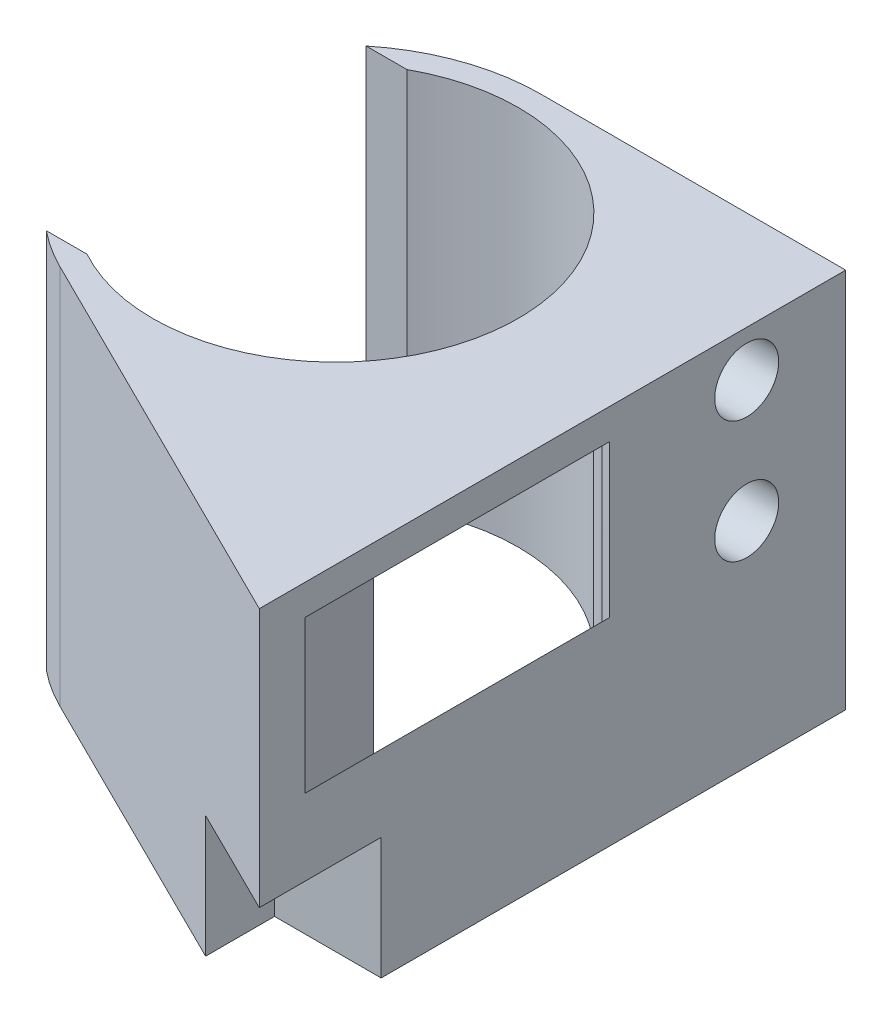
ISO-10303-21;
HEADER;
FILE_DESCRIPTION(('STEP AP214'),'2;1');
FILE_NAME('part.step','',(''),(''),'','','');
FILE_SCHEMA(('AUTOMOTIVE_DESIGN { 1 0 10303 214 1 1 1 1 }'));
ENDSEC;
DATA;
#1=APPLICATION_CONTEXT('core data for automotive mechanical design processes');
#2=APPLICATION_PROTOCOL_DEFINITION('international standard','automotive_design',2000,#1);
#3=PRODUCT_CONTEXT('',#1,'mechanical');
#4=PRODUCT('Part','Part','',(#3));
#5=PRODUCT_RELATED_PRODUCT_CATEGORY('part','',(#4));
#6=PRODUCT_DEFINITION_FORMATION('','',#4);
#7=PRODUCT_DEFINITION_CONTEXT('part definition',#1,'design');
#8=PRODUCT_DEFINITION('design','',#6,#7);
#9=PRODUCT_DEFINITION_SHAPE('','',#8);
#10=(LENGTH_UNIT() NAMED_UNIT(*) SI_UNIT(.MILLI.,.METRE.));
#11=(NAMED_UNIT(*) PLANE_ANGLE_UNIT() SI_UNIT($,.RADIAN.));
#12=(NAMED_UNIT(*) SI_UNIT($,.STERADIAN.) SOLID_ANGLE_UNIT());
#13=UNCERTAINTY_MEASURE_WITH_UNIT(LENGTH_MEASURE(1.E-05),#10,'distance_accuracy_value','');
#14=(GEOMETRIC_REPRESENTATION_CONTEXT(3) GLOBAL_UNCERTAINTY_ASSIGNED_CONTEXT((#13)) GLOBAL_UNIT_ASSIGNED_CONTEXT((#10,
#11,#12)) REPRESENTATION_CONTEXT('',''));
#15=CARTESIAN_POINT('',(0.,0.,0.));
#16=DIRECTION('',(0.,0.,1.));
#17=DIRECTION('',(1.,0.,0.));
#18=AXIS2_PLACEMENT_3D('',#15,#16,#17);
#19=CARTESIAN_POINT('',(0.,25.,0.));
#20=DIRECTION('',(0.,-1.,0.));
#21=DIRECTION('',(0.,0.,-1.));
#22=AXIS2_PLACEMENT_3D('',#19,#20,#21);
#23=CYLINDRICAL_SURFACE('',#22,13.5);
#24=CARTESIAN_POINT('',(0.,0.,0.));
#25=DIRECTION('',(0.,1.,0.));
#26=DIRECTION('',(0.,0.,1.));
#27=AXIS2_PLACEMENT_3D('',#24,#25,#26);
#28=CIRCLE('',#27,13.5);
#29=CARTESIAN_POINT('',(0.,0.,-13.5));
#30=VERTEX_POINT('',#29);
#31=CARTESIAN_POINT('',(-8.48528137423857,0.,-10.5));
#32=VERTEX_POINT('',#31);
#33=EDGE_CURVE('E207',#30,#32,#28,.T.);
#34=ORIENTED_EDGE('',*,*,#33,.T.);
#35=DIRECTION('',(0.,-1.,0.));
#36=VECTOR('',#35,1.);
#37=CARTESIAN_POINT('',(-8.48528137423857,25.,-10.5));
#38=LINE('',#37,#36);
#39=CARTESIAN_POINT('',(-8.48528137423857,25.,-10.5));
#40=VERTEX_POINT('',#39);
#41=EDGE_CURVE('E555',#32,#40,#38,.F.);
#42=ORIENTED_EDGE('',*,*,#41,.T.);
#43=CARTESIAN_POINT('',(0.,25.,0.));
#44=DIRECTION('',(0.,1.,0.));
#45=DIRECTION('',(0.,0.,1.));
#46=AXIS2_PLACEMENT_3D('',#43,#44,#45);
#47=CIRCLE('',#46,13.5);
#48=CARTESIAN_POINT('',(0.,25.,-13.5));
#49=VERTEX_POINT('',#48);
#50=EDGE_CURVE('E196',#49,#40,#47,.T.);
#51=ORIENTED_EDGE('',*,*,#50,.F.);
#52=DIRECTION('',(0.,-1.,0.));
#53=VECTOR('',#52,1.);
#54=CARTESIAN_POINT('',(0.,25.,-13.5));
#55=LINE('',#54,#53);
#56=EDGE_CURVE('E206',#49,#30,#55,.T.);
#57=ORIENTED_EDGE('',*,*,#56,.T.);
#58=EDGE_LOOP('',(#34,#42,#51,#57));
#59=FACE_BOUND('',#58,.T.);
#60=ADVANCED_FACE('F43',(#59),#23,.T.);
#61=CARTESIAN_POINT('',(0.,0.,0.));
#62=DIRECTION('',(0.,1.,0.));
#63=DIRECTION('',(0.,0.,1.));
#64=AXIS2_PLACEMENT_3D('',#61,#62,#63);
#65=PLANE('',#64);
#66=CARTESIAN_POINT('',(0.,0.,0.));
#67=DIRECTION('',(0.,1.,0.));
#68=DIRECTION('',(0.,0.,1.));
#69=AXIS2_PLACEMENT_3D('',#66,#67,#68);
#70=CIRCLE('',#69,12.);
#71=CARTESIAN_POINT('',(-5.80947501931113,0.,10.5));
#72=VERTEX_POINT('',#71);
#73=CARTESIAN_POINT('',(-5.80947501931113,0.,-10.5));
#74=VERTEX_POINT('',#73);
#75=EDGE_CURVE('E183',#72,#74,#70,.T.);
#76=ORIENTED_EDGE('',*,*,#75,.T.);
#77=DIRECTION('',(-1.,0.,0.));
#78=VECTOR('',#77,1.);
#79=CARTESIAN_POINT('',(-13.5,0.,-10.5));
#80=LINE('',#79,#78);
#81=EDGE_CURVE('E176',#74,#32,#80,.T.);
#82=ORIENTED_EDGE('',*,*,#81,.T.);
#83=ORIENTED_EDGE('',*,*,#33,.F.);
#84=DIRECTION('',(-1.,0.,0.));
#85=VECTOR('',#84,1.);
#86=CARTESIAN_POINT('',(0.,0.,-13.5));
#87=LINE('',#86,#85);
#88=CARTESIAN_POINT('',(20.,0.,-13.5));
#89=VERTEX_POINT('',#88);
#90=EDGE_CURVE('E215',#89,#30,#87,.T.);
#91=ORIENTED_EDGE('',*,*,#90,.F.);
#92=DIRECTION('',(0.,0.,-1.));
#93=VECTOR('',#92,1.);
#94=CARTESIAN_POINT('',(20.,0.,-13.5));
#95=LINE('',#94,#93);
#96=CARTESIAN_POINT('',(20.,0.,17.));
#97=VERTEX_POINT('',#96);
#98=EDGE_CURVE('E213',#97,#89,#95,.T.);
#99=ORIENTED_EDGE('',*,*,#98,.F.);
#100=DIRECTION('',(1.,0.,0.));
#101=VECTOR('',#100,1.);
#102=CARTESIAN_POINT('',(20.,0.,17.));
#103=LINE('',#102,#101);
#104=CARTESIAN_POINT('',(13.,0.,17.));
#105=VERTEX_POINT('',#104);
#106=EDGE_CURVE('E568',#105,#97,#103,.T.);
#107=ORIENTED_EDGE('',*,*,#106,.F.);
#108=DIRECTION('',(0.,0.,-1.));
#109=VECTOR('',#108,1.);
#110=CARTESIAN_POINT('',(13.,0.,25.));
#111=LINE('',#110,#109);
#112=CARTESIAN_POINT('',(13.,0.,21.5251426468979));
#113=VERTEX_POINT('',#112);
#114=EDGE_CURVE('E570',#113,#105,#111,.T.);
#115=ORIENTED_EDGE('',*,*,#114,.F.);
#116=DIRECTION('',(0.895710375297357,0.,0.444637969121697));
#117=VECTOR('',#116,1.);
#118=CARTESIAN_POINT('',(20.,0.,25.));
#119=LINE('',#118,#117);
#120=CARTESIAN_POINT('',(-6.00261258314291,0.,12.0920900665143));
#121=VERTEX_POINT('',#120);
#122=EDGE_CURVE('E210',#121,#113,#119,.T.);
#123=ORIENTED_EDGE('',*,*,#122,.F.);
#124=CARTESIAN_POINT('',(-8.48528137423857,0.,10.5));
#125=VERTEX_POINT('',#124);
#126=EDGE_CURVE('E185',#125,#121,#28,.T.);
#127=ORIENTED_EDGE('',*,*,#126,.F.);
#128=DIRECTION('',(1.,0.,0.));
#129=VECTOR('',#128,1.);
#130=CARTESIAN_POINT('',(-13.5,0.,10.5));
#131=LINE('',#130,#129);
#132=EDGE_CURVE('E167',#125,#72,#131,.T.);
#133=ORIENTED_EDGE('',*,*,#132,.T.);
#134=EDGE_LOOP('',(#76,#82,#83,#91,#99,#107,#115,#123,#127,#133));
#135=FACE_BOUND('',#134,.T.);
#136=ADVANCED_FACE('F181',(#135),#65,.F.);
#137=CARTESIAN_POINT('',(20.,25.,25.));
#138=DIRECTION('',(0.444637969121697,0.,-0.895710375297358));
#139=DIRECTION('',(-0.895710375297358,0.,-0.444637969121697));
#140=AXIS2_PLACEMENT_3D('',#137,#138,#139);
#141=PLANE('',#140);
#142=DIRECTION('',(-0.895710375297358,0.,-0.444637969121697));
#143=VECTOR('',#142,1.);
#144=CARTESIAN_POINT('',(20.,8.,25.));
#145=LINE('',#144,#143);
#146=CARTESIAN_POINT('',(20.,8.,25.));
#147=VERTEX_POINT('',#146);
#148=CARTESIAN_POINT('',(13.,8.,21.5251426468979));
#149=VERTEX_POINT('',#148);
#150=EDGE_CURVE('E545',#147,#149,#145,.T.);
#151=ORIENTED_EDGE('',*,*,#150,.F.);
#152=DIRECTION('',(0.,-1.,0.));
#153=VECTOR('',#152,1.);
#154=CARTESIAN_POINT('',(20.,25.,25.));
#155=LINE('',#154,#153);
#156=CARTESIAN_POINT('',(20.,25.,25.));
#157=VERTEX_POINT('',#156);
#158=EDGE_CURVE('E222',#157,#147,#155,.T.);
#159=ORIENTED_EDGE('',*,*,#158,.F.);
#160=DIRECTION('',(0.895710375297357,0.,0.444637969121697));
#161=VECTOR('',#160,1.);
#162=CARTESIAN_POINT('',(20.,25.,25.));
#163=LINE('',#162,#161);
#164=CARTESIAN_POINT('',(-6.00261258314291,25.,12.0920900665143));
#165=VERTEX_POINT('',#164);
#166=EDGE_CURVE('E199',#165,#157,#163,.T.);
#167=ORIENTED_EDGE('',*,*,#166,.F.);
#168=DIRECTION('',(0.,-1.,0.));
#169=VECTOR('',#168,1.);
#170=CARTESIAN_POINT('',(-6.00261258314291,25.,12.0920900665143));
#171=LINE('',#170,#169);
#172=EDGE_CURVE('E225',#165,#121,#171,.T.);
#173=ORIENTED_EDGE('',*,*,#172,.T.);
#174=ORIENTED_EDGE('',*,*,#122,.T.);
#175=DIRECTION('',(0.,-1.,0.));
#176=VECTOR('',#175,1.);
#177=CARTESIAN_POINT('',(13.,25.,21.5251426468979));
#178=LINE('',#177,#176);
#179=EDGE_CURVE('E232',#149,#113,#178,.T.);
#180=ORIENTED_EDGE('',*,*,#179,.F.);
#181=EDGE_LOOP('',(#151,#159,#167,#173,#174,#180));
#182=FACE_BOUND('',#181,.T.);
#183=ADVANCED_FACE('F258',(#182),#141,.F.);
#184=CARTESIAN_POINT('',(20.,25.,-13.5));
#185=DIRECTION('',(-1.,0.,0.));
#186=DIRECTION('',(0.,0.,1.));
#187=AXIS2_PLACEMENT_3D('',#184,#185,#186);
#188=PLANE('',#187);
#189=CARTESIAN_POINT('',(20.,22.,-7.));
#190=DIRECTION('',(1.,0.,0.));
#191=DIRECTION('',(0.,0.,-1.));
#192=AXIS2_PLACEMENT_3D('',#189,#190,#191);
#193=CIRCLE('',#192,2.1);
#194=CARTESIAN_POINT('',(20.,22.,-9.1));
#195=VERTEX_POINT('',#194);
#196=EDGE_CURVE('E758',#195,#195,#193,.T.);
#197=ORIENTED_EDGE('',*,*,#196,.F.);
#198=EDGE_LOOP('',(#197));
#199=FACE_BOUND('',#198,.T.);
#200=CARTESIAN_POINT('',(20.,14.,-7.));
#201=DIRECTION('',(1.,0.,0.));
#202=DIRECTION('',(0.,0.,-1.));
#203=AXIS2_PLACEMENT_3D('',#200,#201,#202);
#204=CIRCLE('',#203,2.1);
#205=CARTESIAN_POINT('',(20.,14.,-9.1));
#206=VERTEX_POINT('',#205);
#207=EDGE_CURVE('E766',#206,#206,#204,.T.);
#208=ORIENTED_EDGE('',*,*,#207,.F.);
#209=EDGE_LOOP('',(#208));
#210=FACE_BOUND('',#209,.T.);
#211=DIRECTION('',(0.,0.,1.));
#212=VECTOR('',#211,1.);
#213=CARTESIAN_POINT('',(20.,23.,22.));
#214=LINE('',#213,#212);
#215=CARTESIAN_POINT('',(20.,23.,2.));
#216=VERTEX_POINT('',#215);
#217=CARTESIAN_POINT('',(20.,23.,22.));
#218=VERTEX_POINT('',#217);
#219=EDGE_CURVE('E356',#216,#218,#214,.T.);
#220=ORIENTED_EDGE('',*,*,#219,.F.);
#221=DIRECTION('',(0.,1.,0.));
#222=VECTOR('',#221,1.);
#223=CARTESIAN_POINT('',(20.,23.,2.));
#224=LINE('',#223,#222);
#225=CARTESIAN_POINT('',(20.,13.,2.));
#226=VERTEX_POINT('',#225);
#227=EDGE_CURVE('E276',#226,#216,#224,.T.);
#228=ORIENTED_EDGE('',*,*,#227,.F.);
#229=DIRECTION('',(0.,0.,-1.));
#230=VECTOR('',#229,1.);
#231=CARTESIAN_POINT('',(20.,13.,22.));
#232=LINE('',#231,#230);
#233=CARTESIAN_POINT('',(20.,13.,22.));
#234=VERTEX_POINT('',#233);
#235=EDGE_CURVE('E280',#234,#226,#232,.T.);
#236=ORIENTED_EDGE('',*,*,#235,.F.);
#237=DIRECTION('',(0.,-1.,0.));
#238=VECTOR('',#237,1.);
#239=CARTESIAN_POINT('',(20.,23.,22.));
#240=LINE('',#239,#238);
#241=EDGE_CURVE('E241',#218,#234,#240,.T.);
#242=ORIENTED_EDGE('',*,*,#241,.F.);
#243=EDGE_LOOP('',(#220,#228,#236,#242));
#244=FACE_BOUND('',#243,.T.);
#245=DIRECTION('',(0.,0.,-1.));
#246=VECTOR('',#245,1.);
#247=CARTESIAN_POINT('',(20.,8.,25.));
#248=LINE('',#247,#246);
#249=CARTESIAN_POINT('',(20.,8.,17.));
#250=VERTEX_POINT('',#249);
#251=EDGE_CURVE('E574',#147,#250,#248,.T.);
#252=ORIENTED_EDGE('',*,*,#251,.T.);
#253=DIRECTION('',(0.,1.,0.));
#254=VECTOR('',#253,1.);
#255=CARTESIAN_POINT('',(20.,0.,17.));
#256=LINE('',#255,#254);
#257=EDGE_CURVE('E556',#97,#250,#256,.T.);
#258=ORIENTED_EDGE('',*,*,#257,.F.);
#259=ORIENTED_EDGE('',*,*,#98,.T.);
#260=DIRECTION('',(0.,-1.,0.));
#261=VECTOR('',#260,1.);
#262=CARTESIAN_POINT('',(20.,25.,-13.5));
#263=LINE('',#262,#261);
#264=CARTESIAN_POINT('',(20.,25.,-13.5));
#265=VERTEX_POINT('',#264);
#266=EDGE_CURVE('E219',#265,#89,#263,.T.);
#267=ORIENTED_EDGE('',*,*,#266,.F.);
#268=DIRECTION('',(0.,0.,-1.));
#269=VECTOR('',#268,1.);
#270=CARTESIAN_POINT('',(20.,25.,-13.5));
#271=LINE('',#270,#269);
#272=EDGE_CURVE('E202',#157,#265,#271,.T.);
#273=ORIENTED_EDGE('',*,*,#272,.F.);
#274=ORIENTED_EDGE('',*,*,#158,.T.);
#275=EDGE_LOOP('',(#252,#258,#259,#267,#273,#274));
#276=FACE_BOUND('',#275,.T.);
#277=ADVANCED_FACE('F247',(#199,#210,#244,#276),#188,.F.);
#278=CARTESIAN_POINT('',(0.,25.,0.));
#279=DIRECTION('',(0.,1.,0.));
#280=DIRECTION('',(0.,0.,1.));
#281=AXIS2_PLACEMENT_3D('',#278,#279,#280);
#282=PLANE('',#281);
#283=DIRECTION('',(-1.,0.,0.));
#284=VECTOR('',#283,1.);
#285=CARTESIAN_POINT('',(-13.5,25.,-10.5));
#286=LINE('',#285,#284);
#287=CARTESIAN_POINT('',(-5.80947501931113,25.,-10.5));
#288=VERTEX_POINT('',#287);
#289=EDGE_CURVE('E186',#288,#40,#286,.T.);
#290=ORIENTED_EDGE('',*,*,#289,.F.);
#291=CARTESIAN_POINT('',(0.,25.,0.));
#292=DIRECTION('',(0.,1.,0.));
#293=DIRECTION('',(0.,0.,1.));
#294=AXIS2_PLACEMENT_3D('',#291,#292,#293);
#295=CIRCLE('',#294,12.);
#296=CARTESIAN_POINT('',(-5.80947501931113,25.,10.5));
#297=VERTEX_POINT('',#296);
#298=EDGE_CURVE('E190',#297,#288,#295,.T.);
#299=ORIENTED_EDGE('',*,*,#298,.F.);
#300=DIRECTION('',(1.,0.,0.));
#301=VECTOR('',#300,1.);
#302=CARTESIAN_POINT('',(-13.5,25.,10.5));
#303=LINE('',#302,#301);
#304=CARTESIAN_POINT('',(-8.48528137423857,25.,10.5));
#305=VERTEX_POINT('',#304);
#306=EDGE_CURVE('E170',#305,#297,#303,.T.);
#307=ORIENTED_EDGE('',*,*,#306,.F.);
#308=EDGE_CURVE('E200',#305,#165,#47,.T.);
#309=ORIENTED_EDGE('',*,*,#308,.T.);
#310=ORIENTED_EDGE('',*,*,#166,.T.);
#311=ORIENTED_EDGE('',*,*,#272,.T.);
#312=DIRECTION('',(-1.,0.,0.));
#313=VECTOR('',#312,1.);
#314=CARTESIAN_POINT('',(0.,25.,-13.5));
#315=LINE('',#314,#313);
#316=EDGE_CURVE('E204',#265,#49,#315,.T.);
#317=ORIENTED_EDGE('',*,*,#316,.T.);
#318=ORIENTED_EDGE('',*,*,#50,.T.);
#319=EDGE_LOOP('',(#290,#299,#307,#309,#310,#311,#317,#318));
#320=FACE_BOUND('',#319,.T.);
#321=ADVANCED_FACE('F257',(#320),#282,.T.);
#322=ORIENTED_EDGE('',*,*,#308,.F.);
#323=DIRECTION('',(0.,-1.,0.));
#324=VECTOR('',#323,1.);
#325=CARTESIAN_POINT('',(-8.48528137423857,25.,10.5));
#326=LINE('',#325,#324);
#327=EDGE_CURVE('E537',#305,#125,#326,.T.);
#328=ORIENTED_EDGE('',*,*,#327,.T.);
#329=ORIENTED_EDGE('',*,*,#126,.T.);
#330=ORIENTED_EDGE('',*,*,#172,.F.);
#331=EDGE_LOOP('',(#322,#328,#329,#330));
#332=FACE_BOUND('',#331,.T.);
#333=ADVANCED_FACE('F447',(#332),#23,.T.);
#334=CARTESIAN_POINT('',(0.,25.,-13.5));
#335=DIRECTION('',(0.,0.,1.));
#336=DIRECTION('',(1.,0.,0.));
#337=AXIS2_PLACEMENT_3D('',#334,#335,#336);
#338=PLANE('',#337);
#339=ORIENTED_EDGE('',*,*,#90,.T.);
#340=ORIENTED_EDGE('',*,*,#56,.F.);
#341=ORIENTED_EDGE('',*,*,#316,.F.);
#342=ORIENTED_EDGE('',*,*,#266,.T.);
#343=EDGE_LOOP('',(#339,#340,#341,#342));
#344=FACE_BOUND('',#343,.T.);
#345=ADVANCED_FACE('F260',(#344),#338,.F.);
#346=CARTESIAN_POINT('',(0.,25.,0.));
#347=DIRECTION('',(0.,-1.,0.));
#348=DIRECTION('',(0.,0.,-1.));
#349=AXIS2_PLACEMENT_3D('',#346,#347,#348);
#350=CYLINDRICAL_SURFACE('',#349,12.);
#351=DIRECTION('',(0.,1.,0.));
#352=VECTOR('',#351,1.);
#353=CARTESIAN_POINT('',(-5.80947501931113,0.,-10.5));
#354=LINE('',#353,#352);
#355=EDGE_CURVE('E175',#74,#288,#354,.T.);
#356=ORIENTED_EDGE('',*,*,#355,.F.);
#357=ORIENTED_EDGE('',*,*,#75,.F.);
#358=DIRECTION('',(0.,1.,0.));
#359=VECTOR('',#358,1.);
#360=CARTESIAN_POINT('',(-5.80947501931113,0.,10.5));
#361=LINE('',#360,#359);
#362=EDGE_CURVE('E164',#72,#297,#361,.T.);
#363=ORIENTED_EDGE('',*,*,#362,.T.);
#364=ORIENTED_EDGE('',*,*,#298,.T.);
#365=EDGE_LOOP('',(#356,#357,#363,#364));
#366=FACE_BOUND('',#365,.T.);
#367=CARTESIAN_POINT('',(8.83290056320423,22.4416450281602,8.12279924906103));
#368=DIRECTION('',(0.,-1.,0.));
#369=VECTOR('',#368,1.);
#370=LINE('',#367,#369);
#371=CARTESIAN_POINT('',(8.83290056320423,22.4416450281602,8.12279924906103));
#372=VERTEX_POINT('',#371);
#373=CARTESIAN_POINT('',(8.83290056320423,1.27454559136444,8.12279924906103));
#374=VERTEX_POINT('',#373);
#375=EDGE_CURVE('E732',#372,#374,#370,.T.);
#376=ORIENTED_EDGE('',*,*,#375,.T.);
#377=CARTESIAN_POINT('',(0.,-8.,0.));
#378=DIRECTION('',(0.724137931034483,-0.689655172413793,0.));
#379=DIRECTION('',(-0.689655172413793,-0.724137931034483,0.));
#380=AXIS2_PLACEMENT_3D('',#377,#378,#379);
#381=ELLIPSE('',#380,17.4,12.);
#382=CARTESIAN_POINT('',(8.83290056320423,1.27454559136444,-8.12279924906103));
#383=VERTEX_POINT('',#382);
#384=EDGE_CURVE('E60',#383,#374,#381,.T.);
#385=ORIENTED_EDGE('',*,*,#384,.F.);
#386=CARTESIAN_POINT('',(8.83290056320423,1.27454559136444,-8.12279924906103));
#387=DIRECTION('',(0.,1.,0.));
#388=VECTOR('',#387,1.);
#389=LINE('',#386,#388);
#390=CARTESIAN_POINT('',(8.83290056320423,22.4416450281602,-8.12279924906103));
#391=VERTEX_POINT('',#390);
#392=EDGE_CURVE('E319',#383,#391,#389,.T.);
#393=ORIENTED_EDGE('',*,*,#392,.T.);
#394=CARTESIAN_POINT('',(0.,22.,0.));
#395=DIRECTION('',(-0.0499376169438923,0.998752338877845,0.));
#396=DIRECTION('',(-0.998752338877845,-0.0499376169438923,0.));
#397=AXIS2_PLACEMENT_3D('',#394,#395,#396);
#398=ELLIPSE('',#397,12.0149906367005,12.);
#399=EDGE_CURVE('E68',#372,#391,#398,.T.);
#400=ORIENTED_EDGE('',*,*,#399,.F.);
#401=EDGE_LOOP('',(#376,#385,#393,#400));
#402=FACE_BOUND('',#401,.T.);
#403=ADVANCED_FACE('F189',(#366,#402),#350,.F.);
#404=CARTESIAN_POINT('',(8.48883048620237,0.,-8.93561103810775));
#405=DIRECTION('',(0.688749461914693,0.,-0.724999433594414));
#406=DIRECTION('',(-0.724999433594414,0.,-0.688749461914693));
#407=AXIS2_PLACEMENT_3D('',#404,#405,#406);
#408=PLANE('',#407);
#409=DIRECTION('',(-0.576869744537761,-0.605713231764649,-0.548026257310873));
#410=VECTOR('',#409,1.);
#411=CARTESIAN_POINT('',(20.,13.,2.));
#412=LINE('',#411,#410);
#413=CARTESIAN_POINT('',(10.,2.5,-7.5));
#414=VERTEX_POINT('',#413);
#415=EDGE_CURVE('E349',#226,#414,#412,.T.);
#416=ORIENTED_EDGE('',*,*,#415,.F.);
#417=ORIENTED_EDGE('',*,*,#227,.T.);
#418=DIRECTION('',(-0.724523556002218,-0.0362261778001109,-0.688297378202108));
#419=VECTOR('',#418,1.);
#420=CARTESIAN_POINT('',(20.,23.,2.));
#421=LINE('',#420,#419);
#422=CARTESIAN_POINT('',(10.,22.5,-7.5));
#423=VERTEX_POINT('',#422);
#424=EDGE_CURVE('E350',#216,#423,#421,.T.);
#425=ORIENTED_EDGE('',*,*,#424,.T.);
#426=DIRECTION('',(0.,1.,0.));
#427=VECTOR('',#426,1.);
#428=CARTESIAN_POINT('',(10.,22.5,-7.5));
#429=LINE('',#428,#427);
#430=EDGE_CURVE('E48',#414,#423,#429,.T.);
#431=ORIENTED_EDGE('',*,*,#430,.F.);
#432=EDGE_LOOP('',(#416,#417,#425,#431));
#433=FACE_BOUND('',#432,.T.);
#434=ADVANCED_FACE('F348',(#433),#408,.F.);
#435=CARTESIAN_POINT('',(-1.09725685785536,21.9451371571072,0.));
#436=DIRECTION('',(-0.0499376169438923,0.998752338877845,0.));
#437=DIRECTION('',(-0.998752338877845,-0.0499376169438923,0.));
#438=AXIS2_PLACEMENT_3D('',#435,#436,#437);
#439=PLANE('',#438);
#440=ORIENTED_EDGE('',*,*,#399,.T.);
#441=CARTESIAN_POINT('',(8.83290056320423,22.4416450281602,-8.12279924906103));
#442=CARTESIAN_POINT('',(8.94706353194102,22.447353176597,-7.99865606640526));
#443=CARTESIAN_POINT('',(9.0808389490505,22.4540419474525,-7.89504745103891));
#444=CARTESIAN_POINT('',(9.14706570025628,22.4573532850128,-7.84375505262293));
#445=CARTESIAN_POINT('',(9.21829668818082,22.460914834409,-7.79762151503057));
#446=CARTESIAN_POINT('',(9.28860555456846,22.4644302777284,-7.75208519965605));
#447=CARTESIAN_POINT('',(9.36346669722402,22.4681733348612,-7.71211062959301));
#448=CARTESIAN_POINT('',(9.4373587241325,22.4718679362066,-7.67265355076717));
#449=CARTESIAN_POINT('',(9.51531876113139,22.4757659380566,-7.63912163219622));
#450=CARTESIAN_POINT('',(9.59226956560928,22.4796134782805,-7.60602380144791));
#451=CARTESIAN_POINT('',(9.67277524491176,22.4836387622456,-7.57917249734473));
#452=CARTESIAN_POINT('',(9.75223873705377,22.4876119368527,-7.55266879709536));
#453=CARTESIAN_POINT('',(9.83471874118755,22.4917359370594,-7.53268866071421));
#454=CARTESIAN_POINT('',(9.916399280198,22.4958199640099,-7.51290218851098));
#455=CARTESIAN_POINT('',(10.,22.5,-7.5));
#456=B_SPLINE_CURVE_WITH_KNOTS('',2,(#441,#442,#443,#444,#445,#446,#447,#448,#449,#450,#451,
#452,#453,#454,#455),.UNSPECIFIED.,.F.,.F.,(3,2,2,2,2,2,2,3),(0.,0.25,0.375,0.5,0.625,0.75,
0.875,1.),.UNSPECIFIED.);
#457=EDGE_CURVE('E54',#391,#423,#456,.T.);
#458=ORIENTED_EDGE('',*,*,#457,.T.);
#459=ORIENTED_EDGE('',*,*,#424,.F.);
#460=ORIENTED_EDGE('',*,*,#219,.T.);
#461=DIRECTION('',(-0.567504353839166,-0.0283752176919583,-0.82288131306679));
#462=VECTOR('',#461,1.);
#463=CARTESIAN_POINT('',(20.,23.,22.));
#464=LINE('',#463,#462);
#465=CARTESIAN_POINT('',(10.,22.5,7.5));
#466=VERTEX_POINT('',#465);
#467=EDGE_CURVE('E301',#218,#466,#464,.T.);
#468=ORIENTED_EDGE('',*,*,#467,.T.);
#469=CARTESIAN_POINT('',(10.,22.5,7.5));
#470=CARTESIAN_POINT('',(9.83331773906795,22.4916658869534,7.52572425162218));
#471=CARTESIAN_POINT('',(9.67277524491176,22.4836387622456,7.57917249734473));
#472=CARTESIAN_POINT('',(9.5932972059106,22.4796648602955,7.60563254320617));
#473=CARTESIAN_POINT('',(9.51531876113139,22.4757659380566,7.63912163219622));
#474=CARTESIAN_POINT('',(9.4383497871674,22.4719174893584,7.67217718781613));
#475=CARTESIAN_POINT('',(9.36346669722402,22.4681733348612,7.71211062959301));
#476=CARTESIAN_POINT('',(9.28955300714624,22.4644776503573,7.75152711255955));
#477=CARTESIAN_POINT('',(9.21829668818082,22.460914834409,7.79762151503057));
#478=CARTESIAN_POINT('',(9.14796281867722,22.4573981409339,7.84311920190682));
#479=CARTESIAN_POINT('',(9.0808389490505,22.4540419474525,7.89504745103891));
#480=CARTESIAN_POINT('',(9.01458403221764,22.4507292016109,7.94630346244969));
#481=CARTESIAN_POINT('',(8.9520689639041,22.4476034481952,8.00369704367191));
#482=CARTESIAN_POINT('',(8.8901598438735,22.4445079921937,8.06053431834386));
#483=CARTESIAN_POINT('',(8.83290056320423,22.4416450281602,8.12279924906103));
#484=B_SPLINE_CURVE_WITH_KNOTS('',2,(#469,#470,#471,#472,#473,#474,#475,#476,#477,#478,#479,
#480,#481,#482,#483),.UNSPECIFIED.,.F.,.F.,(3,2,2,2,2,2,2,3),(0.,0.25,0.375,0.5,0.625,0.75,
0.875,1.),.UNSPECIFIED.);
#485=EDGE_CURVE('E405',#466,#372,#484,.T.);
#486=ORIENTED_EDGE('',*,*,#485,.T.);
#487=EDGE_LOOP('',(#440,#458,#459,#460,#468,#486));
#488=FACE_BOUND('',#487,.T.);
#489=ADVANCED_FACE('F384',(#488),#439,.F.);
#490=CARTESIAN_POINT('',(3.99524375743163,-3.80499405469679,0.));
#491=DIRECTION('',(0.724137931034483,-0.689655172413793,0.));
#492=DIRECTION('',(0.689655172413793,0.724137931034483,0.));
#493=AXIS2_PLACEMENT_3D('',#490,#491,#492);
#494=PLANE('',#493);
#495=ORIENTED_EDGE('',*,*,#384,.T.);
#496=CARTESIAN_POINT('',(8.83290056320423,1.27454559136444,8.12279924906103));
#497=CARTESIAN_POINT('',(8.94710985717466,1.39446535003339,7.99860569138432));
#498=CARTESIAN_POINT('',(9.0808389490505,1.53488089650302,7.89504745103891));
#499=CARTESIAN_POINT('',(9.14719004642263,1.60454954874376,7.84366593941371));
#500=CARTESIAN_POINT('',(9.21829668818081,1.67921152258985,7.79762151503057));
#501=CARTESIAN_POINT('',(9.2887521248351,1.75318973107685,7.75199877227131));
#502=CARTESIAN_POINT('',(9.36346669722402,1.83164003208522,7.71211062959301));
#503=CARTESIAN_POINT('',(9.43751204862741,1.90938765105877,7.67257976637575));
#504=CARTESIAN_POINT('',(9.51531876113139,1.99108469918796,7.63912163219622));
#505=CARTESIAN_POINT('',(9.59242855624609,2.0720499840584,7.60596318367069));
#506=CARTESIAN_POINT('',(9.67277524491176,2.15641400715735,7.57917249734474));
#507=CARTESIAN_POINT('',(9.7524022655345,2.24002237881123,7.552621776114));
#508=CARTESIAN_POINT('',(9.83471874118754,2.32645467824692,7.53268866071421));
#509=CARTESIAN_POINT('',(9.91648297598527,2.41230712478453,7.51288927165061));
#510=CARTESIAN_POINT('',(10.,2.5,7.5));
#511=B_SPLINE_CURVE_WITH_KNOTS('',2,(#496,#497,#498,#499,#500,#501,#502,#503,#504,#505,#506,
#507,#508,#509,#510),.UNSPECIFIED.,.F.,.F.,(3,2,2,2,2,2,2,3),(0.,0.25,0.375,0.5,0.625,0.75,
0.875,1.),.UNSPECIFIED.);
#512=CARTESIAN_POINT('',(10.,2.5,7.5));
#513=VERTEX_POINT('',#512);
#514=EDGE_CURVE('E433',#374,#513,#511,.T.);
#515=ORIENTED_EDGE('',*,*,#514,.T.);
#516=DIRECTION('',(-0.487659849094171,-0.512042841548879,-0.707106781186548));
#517=VECTOR('',#516,1.);
#518=CARTESIAN_POINT('',(20.,13.,22.));
#519=LINE('',#518,#517);
#520=EDGE_CURVE('E358',#234,#513,#519,.T.);
#521=ORIENTED_EDGE('',*,*,#520,.F.);
#522=ORIENTED_EDGE('',*,*,#235,.T.);
#523=ORIENTED_EDGE('',*,*,#415,.T.);
#524=CARTESIAN_POINT('',(10.,2.5,-7.5));
#525=CARTESIAN_POINT('',(9.83323290118481,2.32489454624405,-7.52573734474343));
#526=CARTESIAN_POINT('',(9.67277524491176,2.15641400715735,-7.57917249734473));
#527=CARTESIAN_POINT('',(9.59313815905602,2.07279506700882,-7.60569301331303));
#528=CARTESIAN_POINT('',(9.51531876113139,1.99108469918796,-7.63912163219622));
#529=CARTESIAN_POINT('',(9.43819639422405,1.91010621393525,-7.67225082979309));
#530=CARTESIAN_POINT('',(9.36346669722402,1.83164003208521,-7.71211062959301));
#531=CARTESIAN_POINT('',(9.28940635668311,1.75387667451726,-7.751613403799));
#532=CARTESIAN_POINT('',(9.21829668818081,1.67921152258985,-7.79762151503057));
#533=CARTESIAN_POINT('',(9.14783852107722,1.60523044713108,-7.84320810343058));
#534=CARTESIAN_POINT('',(9.0808389490505,1.53488089650302,-7.89504745103891));
#535=CARTESIAN_POINT('',(9.01448032076904,1.46520433680749,-7.9463908834555));
#536=CARTESIAN_POINT('',(8.9520689639041,1.3996724120993,-8.0036970436719));
#537=CARTESIAN_POINT('',(8.89011415621618,1.33461986402699,-8.06058400005107));
#538=CARTESIAN_POINT('',(8.83290056320422,1.27454559136444,-8.12279924906103));
#539=B_SPLINE_CURVE_WITH_KNOTS('',2,(#524,#525,#526,#527,#528,#529,#530,#531,#532,#533,#534,
#535,#536,#537,#538),.UNSPECIFIED.,.F.,.F.,(3,2,2,2,2,2,2,3),(0.,0.25,0.375,0.5,0.625,0.75,
0.875,1.),.UNSPECIFIED.);
#540=EDGE_CURVE('E12',#414,#383,#539,.T.);
#541=ORIENTED_EDGE('',*,*,#540,.T.);
#542=EDGE_LOOP('',(#495,#515,#521,#522,#523,#541));
#543=FACE_BOUND('',#542,.T.);
#544=ADVANCED_FACE('F353',(#543),#494,.F.);
#545=CARTESIAN_POINT('',(3.27155519742144,0.,-2.25624496373892));
#546=DIRECTION('',(-0.823212785915306,0.,0.567732955803659));
#547=DIRECTION('',(0.56773295580366,0.,0.823212785915306));
#548=AXIS2_PLACEMENT_3D('',#545,#546,#547);
#549=PLANE('',#548);
#550=ORIENTED_EDGE('',*,*,#467,.F.);
#551=ORIENTED_EDGE('',*,*,#241,.T.);
#552=ORIENTED_EDGE('',*,*,#520,.T.);
#553=DIRECTION('',(0.,-1.,0.));
#554=VECTOR('',#553,1.);
#555=CARTESIAN_POINT('',(10.,22.5,7.5));
#556=LINE('',#555,#554);
#557=EDGE_CURVE('E194',#466,#513,#556,.T.);
#558=ORIENTED_EDGE('',*,*,#557,.F.);
#559=EDGE_LOOP('',(#550,#551,#552,#558));
#560=FACE_BOUND('',#559,.T.);
#561=ADVANCED_FACE('F383',(#560),#549,.F.);
#562=CARTESIAN_POINT('',(13.,0.,25.));
#563=DIRECTION('',(1.,0.,0.));
#564=DIRECTION('',(0.,0.,-1.));
#565=AXIS2_PLACEMENT_3D('',#562,#563,#564);
#566=PLANE('',#565);
#567=ORIENTED_EDGE('',*,*,#179,.T.);
#568=ORIENTED_EDGE('',*,*,#114,.T.);
#569=DIRECTION('',(0.,-1.,0.));
#570=VECTOR('',#569,1.);
#571=CARTESIAN_POINT('',(13.,0.,17.));
#572=LINE('',#571,#570);
#573=CARTESIAN_POINT('',(13.,8.,17.));
#574=VERTEX_POINT('',#573);
#575=EDGE_CURVE('E565',#574,#105,#572,.T.);
#576=ORIENTED_EDGE('',*,*,#575,.F.);
#577=DIRECTION('',(0.,0.,-1.));
#578=VECTOR('',#577,1.);
#579=CARTESIAN_POINT('',(13.,8.,25.));
#580=LINE('',#579,#578);
#581=EDGE_CURVE('E572',#149,#574,#580,.T.);
#582=ORIENTED_EDGE('',*,*,#581,.F.);
#583=EDGE_LOOP('',(#567,#568,#576,#582));
#584=FACE_BOUND('',#583,.T.);
#585=ADVANCED_FACE('F490',(#584),#566,.T.);
#586=CARTESIAN_POINT('',(20.,8.,25.));
#587=DIRECTION('',(0.,-1.,0.));
#588=DIRECTION('',(1.,0.,0.));
#589=AXIS2_PLACEMENT_3D('',#586,#587,#588);
#590=PLANE('',#589);
#591=ORIENTED_EDGE('',*,*,#150,.T.);
#592=ORIENTED_EDGE('',*,*,#581,.T.);
#593=DIRECTION('',(-1.,0.,0.));
#594=VECTOR('',#593,1.);
#595=CARTESIAN_POINT('',(20.,8.,17.));
#596=LINE('',#595,#594);
#597=EDGE_CURVE('E559',#250,#574,#596,.T.);
#598=ORIENTED_EDGE('',*,*,#597,.F.);
#599=ORIENTED_EDGE('',*,*,#251,.F.);
#600=EDGE_LOOP('',(#591,#592,#598,#599));
#601=FACE_BOUND('',#600,.T.);
#602=ADVANCED_FACE('F485',(#601),#590,.T.);
#603=CARTESIAN_POINT('',(0.,0.,17.));
#604=DIRECTION('',(0.,0.,1.));
#605=DIRECTION('',(1.,0.,0.));
#606=AXIS2_PLACEMENT_3D('',#603,#604,#605);
#607=PLANE('',#606);
#608=ORIENTED_EDGE('',*,*,#257,.T.);
#609=ORIENTED_EDGE('',*,*,#597,.T.);
#610=ORIENTED_EDGE('',*,*,#575,.T.);
#611=ORIENTED_EDGE('',*,*,#106,.T.);
#612=EDGE_LOOP('',(#608,#609,#610,#611));
#613=FACE_BOUND('',#612,.T.);
#614=ADVANCED_FACE('F489',(#613),#607,.T.);
#615=CARTESIAN_POINT('',(-13.5,0.,10.5));
#616=DIRECTION('',(0.,0.,1.));
#617=DIRECTION('',(1.,0.,0.));
#618=AXIS2_PLACEMENT_3D('',#615,#616,#617);
#619=PLANE('',#618);
#620=ORIENTED_EDGE('',*,*,#306,.T.);
#621=ORIENTED_EDGE('',*,*,#362,.F.);
#622=ORIENTED_EDGE('',*,*,#132,.F.);
#623=ORIENTED_EDGE('',*,*,#327,.F.);
#624=EDGE_LOOP('',(#620,#621,#622,#623));
#625=FACE_BOUND('',#624,.T.);
#626=ADVANCED_FACE('F166',(#625),#619,.F.);
#627=CARTESIAN_POINT('',(-13.5,0.,-10.5));
#628=DIRECTION('',(0.,0.,-1.));
#629=DIRECTION('',(-1.,0.,0.));
#630=AXIS2_PLACEMENT_3D('',#627,#628,#629);
#631=PLANE('',#630);
#632=ORIENTED_EDGE('',*,*,#81,.F.);
#633=ORIENTED_EDGE('',*,*,#355,.T.);
#634=ORIENTED_EDGE('',*,*,#289,.T.);
#635=ORIENTED_EDGE('',*,*,#41,.F.);
#636=EDGE_LOOP('',(#632,#633,#634,#635));
#637=FACE_BOUND('',#636,.T.);
#638=ADVANCED_FACE('F446',(#637),#631,.F.);
#639=CARTESIAN_POINT('',(10.3050506570716,0.,9.47659912390454));
#640=DIRECTION('',(0.,-1.,0.));
#641=DIRECTION('',(0.,0.,-1.));
#642=AXIS2_PLACEMENT_3D('',#639,#640,#641);
#643=CYLINDRICAL_SURFACE('',#642,2.);
#644=ORIENTED_EDGE('',*,*,#485,.F.);
#645=ORIENTED_EDGE('',*,*,#557,.T.);
#646=ORIENTED_EDGE('',*,*,#514,.F.);
#647=ORIENTED_EDGE('',*,*,#375,.F.);
#648=EDGE_LOOP('',(#644,#645,#646,#647));
#649=FACE_BOUND('',#648,.T.);
#650=ADVANCED_FACE('F438',(#649),#643,.T.);
#651=CARTESIAN_POINT('',(10.3050506570716,0.,-9.47659912390454));
#652=DIRECTION('',(0.,1.,0.));
#653=DIRECTION('',(0.,0.,1.));
#654=AXIS2_PLACEMENT_3D('',#651,#652,#653);
#655=CYLINDRICAL_SURFACE('',#654,2.);
#656=ORIENTED_EDGE('',*,*,#540,.F.);
#657=ORIENTED_EDGE('',*,*,#430,.T.);
#658=ORIENTED_EDGE('',*,*,#457,.F.);
#659=ORIENTED_EDGE('',*,*,#392,.F.);
#660=EDGE_LOOP('',(#656,#657,#658,#659));
#661=FACE_BOUND('',#660,.T.);
#662=ADVANCED_FACE('F45',(#661),#655,.T.);
#663=CARTESIAN_POINT('',(16.,14.,-7.));
#664=DIRECTION('',(1.,0.,0.));
#665=DIRECTION('',(0.,0.,-1.));
#666=AXIS2_PLACEMENT_3D('',#663,#664,#665);
#667=CYLINDRICAL_SURFACE('',#666,2.1);
#668=CARTESIAN_POINT('',(16.,14.,-7.));
#669=DIRECTION('',(1.,0.,0.));
#670=DIRECTION('',(0.,0.,-1.));
#671=AXIS2_PLACEMENT_3D('',#668,#669,#670);
#672=CIRCLE('',#671,2.1);
#673=CARTESIAN_POINT('',(16.,14.,-9.1));
#674=VERTEX_POINT('',#673);
#675=EDGE_CURVE('E762',#674,#674,#672,.T.);
#676=ORIENTED_EDGE('',*,*,#675,.F.);
#677=EDGE_LOOP('',(#676));
#678=FACE_BOUND('',#677,.T.);
#679=ORIENTED_EDGE('',*,*,#207,.T.);
#680=EDGE_LOOP('',(#679));
#681=FACE_BOUND('',#680,.T.);
#682=ADVANCED_FACE('F503',(#678,#681),#667,.F.);
#683=CARTESIAN_POINT('',(16.,14.,-7.));
#684=DIRECTION('',(1.,0.,0.));
#685=DIRECTION('',(0.,0.,-1.));
#686=AXIS2_PLACEMENT_3D('',#683,#684,#685);
#687=PLANE('',#686);
#688=ORIENTED_EDGE('',*,*,#675,.T.);
#689=EDGE_LOOP('',(#688));
#690=FACE_BOUND('',#689,.T.);
#691=ADVANCED_FACE('F506',(#690),#687,.T.);
#692=CARTESIAN_POINT('',(16.,22.,-7.));
#693=DIRECTION('',(1.,0.,0.));
#694=DIRECTION('',(0.,0.,-1.));
#695=AXIS2_PLACEMENT_3D('',#692,#693,#694);
#696=CYLINDRICAL_SURFACE('',#695,2.1);
#697=CARTESIAN_POINT('',(16.,22.,-7.));
#698=DIRECTION('',(1.,0.,0.));
#699=DIRECTION('',(0.,0.,-1.));
#700=AXIS2_PLACEMENT_3D('',#697,#698,#699);
#701=CIRCLE('',#700,2.1);
#702=CARTESIAN_POINT('',(16.,22.,-9.1));
#703=VERTEX_POINT('',#702);
#704=EDGE_CURVE('E756',#703,#703,#701,.T.);
#705=ORIENTED_EDGE('',*,*,#704,.F.);
#706=EDGE_LOOP('',(#705));
#707=FACE_BOUND('',#706,.T.);
#708=ORIENTED_EDGE('',*,*,#196,.T.);
#709=EDGE_LOOP('',(#708));
#710=FACE_BOUND('',#709,.T.);
#711=ADVANCED_FACE('F510',(#707,#710),#696,.F.);
#712=CARTESIAN_POINT('',(16.,22.,-7.));
#713=DIRECTION('',(1.,0.,0.));
#714=DIRECTION('',(0.,0.,-1.));
#715=AXIS2_PLACEMENT_3D('',#712,#713,#714);
#716=PLANE('',#715);
#717=ORIENTED_EDGE('',*,*,#704,.T.);
#718=EDGE_LOOP('',(#717));
#719=FACE_BOUND('',#718,.T.);
#720=ADVANCED_FACE('F514',(#719),#716,.T.);
#721=CLOSED_SHELL('',(#60,#136,#183,#277,#321,#333,#345,#403,#434,#489,#544,#561,#585,#602,#614,
#626,#638,#650,#662,#682,#691,#711,#720));
#722=MANIFOLD_SOLID_BREP('B2',#721);
#723=ADVANCED_BREP_SHAPE_REPRESENTATION('',(#18,#722),#14);
#724=SHAPE_DEFINITION_REPRESENTATION(#9,#723);
ENDSEC;
END-ISO-10303-21;
